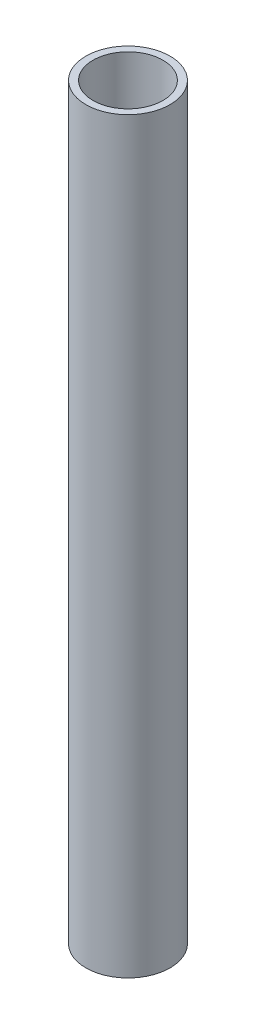
ISO-10303-21;
HEADER;
FILE_DESCRIPTION(('STEP AP214'),'2;1');
FILE_NAME('part.step','',(''),(''),'','','');
FILE_SCHEMA(('AUTOMOTIVE_DESIGN { 1 0 10303 214 1 1 1 1 }'));
ENDSEC;
DATA;
#1=APPLICATION_CONTEXT('core data for automotive mechanical design processes');
#2=APPLICATION_PROTOCOL_DEFINITION('international standard','automotive_design',2000,#1);
#3=PRODUCT_CONTEXT('',#1,'mechanical');
#4=PRODUCT('Part','Part','',(#3));
#5=PRODUCT_RELATED_PRODUCT_CATEGORY('part','',(#4));
#6=PRODUCT_DEFINITION_FORMATION('','',#4);
#7=PRODUCT_DEFINITION_CONTEXT('part definition',#1,'design');
#8=PRODUCT_DEFINITION('design','',#6,#7);
#9=PRODUCT_DEFINITION_SHAPE('','',#8);
#10=(LENGTH_UNIT() NAMED_UNIT(*) SI_UNIT(.MILLI.,.METRE.));
#11=(NAMED_UNIT(*) PLANE_ANGLE_UNIT() SI_UNIT($,.RADIAN.));
#12=(NAMED_UNIT(*) SI_UNIT($,.STERADIAN.) SOLID_ANGLE_UNIT());
#13=UNCERTAINTY_MEASURE_WITH_UNIT(LENGTH_MEASURE(1.E-05),#10,'distance_accuracy_value','');
#14=(GEOMETRIC_REPRESENTATION_CONTEXT(3) GLOBAL_UNCERTAINTY_ASSIGNED_CONTEXT((#13)) GLOBAL_UNIT_ASSIGNED_CONTEXT((#10,
#11,#12)) REPRESENTATION_CONTEXT('',''));
#15=CARTESIAN_POINT('',(0.,0.,0.));
#16=DIRECTION('',(0.,0.,1.));
#17=DIRECTION('',(1.,0.,0.));
#18=AXIS2_PLACEMENT_3D('',#15,#16,#17);
#19=CARTESIAN_POINT('',(0.,374.65,0.));
#20=DIRECTION('',(0.,1.,0.));
#21=DIRECTION('',(0.,0.,1.));
#22=AXIS2_PLACEMENT_3D('',#19,#20,#21);
#23=PLANE('',#22);
#24=CARTESIAN_POINT('',(0.,374.65,0.));
#25=DIRECTION('',(0.,1.,0.));
#26=DIRECTION('',(0.,0.,1.));
#27=AXIS2_PLACEMENT_3D('',#24,#25,#26);
#28=CIRCLE('',#27,21.082);
#29=CARTESIAN_POINT('',(0.,374.65,21.082));
#30=VERTEX_POINT('',#29);
#31=EDGE_CURVE('E10',#30,#30,#28,.T.);
#32=ORIENTED_EDGE('',*,*,#31,.T.);
#33=EDGE_LOOP('',(#32));
#34=FACE_BOUND('',#33,.T.);
#35=CARTESIAN_POINT('',(0.,374.65,0.));
#36=DIRECTION('',(0.,1.,0.));
#37=DIRECTION('',(0.,0.,1.));
#38=AXIS2_PLACEMENT_3D('',#35,#36,#37);
#39=CIRCLE('',#38,17.526);
#40=CARTESIAN_POINT('',(0.,374.65,17.526));
#41=VERTEX_POINT('',#40);
#42=EDGE_CURVE('E44',#41,#41,#39,.T.);
#43=ORIENTED_EDGE('',*,*,#42,.F.);
#44=EDGE_LOOP('',(#43));
#45=FACE_BOUND('',#44,.T.);
#46=ADVANCED_FACE('F33',(#34,#45),#23,.T.);
#47=CARTESIAN_POINT('',(0.,0.,0.));
#48=DIRECTION('',(0.,1.,0.));
#49=DIRECTION('',(0.,0.,1.));
#50=AXIS2_PLACEMENT_3D('',#47,#48,#49);
#51=PLANE('',#50);
#52=CARTESIAN_POINT('',(0.,0.,0.));
#53=DIRECTION('',(0.,1.,0.));
#54=DIRECTION('',(0.,0.,1.));
#55=AXIS2_PLACEMENT_3D('',#52,#53,#54);
#56=CIRCLE('',#55,21.082);
#57=CARTESIAN_POINT('',(0.,0.,21.082));
#58=VERTEX_POINT('',#57);
#59=EDGE_CURVE('E37',#58,#58,#56,.T.);
#60=ORIENTED_EDGE('',*,*,#59,.F.);
#61=EDGE_LOOP('',(#60));
#62=FACE_BOUND('',#61,.T.);
#63=CARTESIAN_POINT('',(0.,0.,0.));
#64=DIRECTION('',(0.,1.,0.));
#65=DIRECTION('',(0.,0.,1.));
#66=AXIS2_PLACEMENT_3D('',#63,#64,#65);
#67=CIRCLE('',#66,17.526);
#68=CARTESIAN_POINT('',(0.,0.,17.526));
#69=VERTEX_POINT('',#68);
#70=EDGE_CURVE('E46',#69,#69,#67,.T.);
#71=ORIENTED_EDGE('',*,*,#70,.T.);
#72=EDGE_LOOP('',(#71));
#73=FACE_BOUND('',#72,.T.);
#74=ADVANCED_FACE('F56',(#62,#73),#51,.F.);
#75=CARTESIAN_POINT('',(0.,374.65,0.));
#76=DIRECTION('',(0.,-1.,0.));
#77=DIRECTION('',(0.,0.,-1.));
#78=AXIS2_PLACEMENT_3D('',#75,#76,#77);
#79=CYLINDRICAL_SURFACE('',#78,21.082);
#80=ORIENTED_EDGE('',*,*,#31,.F.);
#81=EDGE_LOOP('',(#80));
#82=FACE_BOUND('',#81,.T.);
#83=ORIENTED_EDGE('',*,*,#59,.T.);
#84=EDGE_LOOP('',(#83));
#85=FACE_BOUND('',#84,.T.);
#86=ADVANCED_FACE('F35',(#82,#85),#79,.T.);
#87=CARTESIAN_POINT('',(0.,374.65,0.));
#88=DIRECTION('',(0.,-1.,0.));
#89=DIRECTION('',(0.,0.,-1.));
#90=AXIS2_PLACEMENT_3D('',#87,#88,#89);
#91=CYLINDRICAL_SURFACE('',#90,17.526);
#92=ORIENTED_EDGE('',*,*,#42,.T.);
#93=EDGE_LOOP('',(#92));
#94=FACE_BOUND('',#93,.T.);
#95=ORIENTED_EDGE('',*,*,#70,.F.);
#96=EDGE_LOOP('',(#95));
#97=FACE_BOUND('',#96,.T.);
#98=ADVANCED_FACE('F52',(#94,#97),#91,.F.);
#99=CLOSED_SHELL('',(#46,#74,#86,#98));
#100=MANIFOLD_SOLID_BREP('B2',#99);
#101=ADVANCED_BREP_SHAPE_REPRESENTATION('',(#18,#100),#14);
#102=SHAPE_DEFINITION_REPRESENTATION(#9,#101);
ENDSEC;
END-ISO-10303-21;
